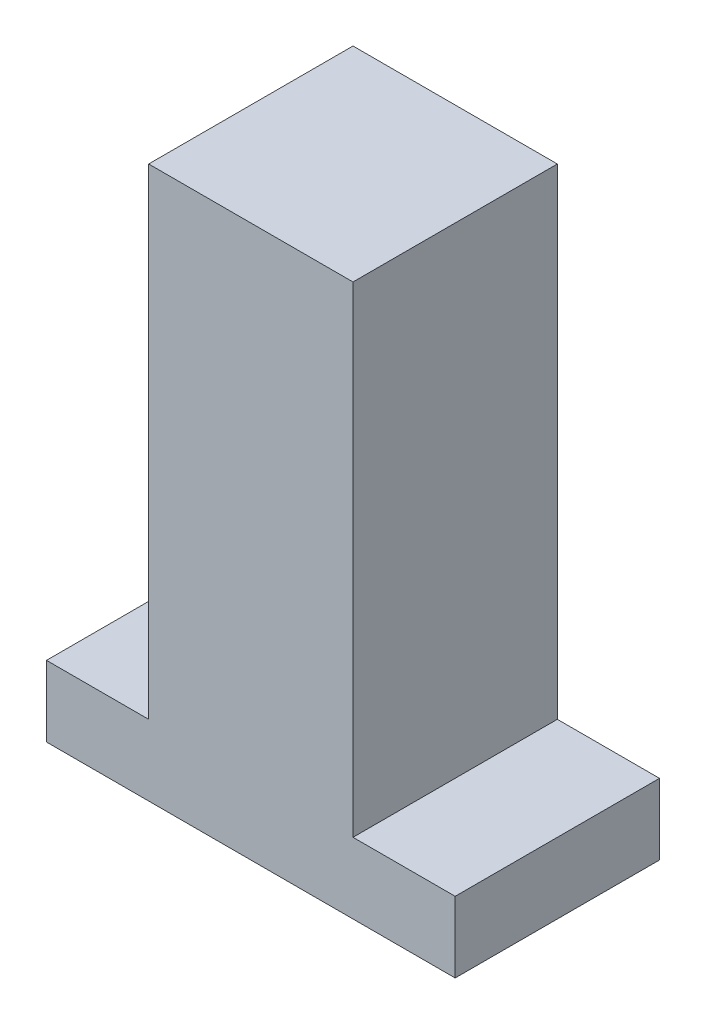
ISO-10303-21;
HEADER;
FILE_DESCRIPTION(('STEP AP214'),'2;1');
FILE_NAME('part.step','',(''),(''),'','','');
FILE_SCHEMA(('AUTOMOTIVE_DESIGN { 1 0 10303 214 1 1 1 1 }'));
ENDSEC;
DATA;
#1=APPLICATION_CONTEXT('core data for automotive mechanical design processes');
#2=APPLICATION_PROTOCOL_DEFINITION('international standard','automotive_design',2000,#1);
#3=PRODUCT_CONTEXT('',#1,'mechanical');
#4=PRODUCT('Part','Part','',(#3));
#5=PRODUCT_RELATED_PRODUCT_CATEGORY('part','',(#4));
#6=PRODUCT_DEFINITION_FORMATION('','',#4);
#7=PRODUCT_DEFINITION_CONTEXT('part definition',#1,'design');
#8=PRODUCT_DEFINITION('design','',#6,#7);
#9=PRODUCT_DEFINITION_SHAPE('','',#8);
#10=(LENGTH_UNIT() NAMED_UNIT(*) SI_UNIT(.MILLI.,.METRE.));
#11=(NAMED_UNIT(*) PLANE_ANGLE_UNIT() SI_UNIT($,.RADIAN.));
#12=(NAMED_UNIT(*) SI_UNIT($,.STERADIAN.) SOLID_ANGLE_UNIT());
#13=UNCERTAINTY_MEASURE_WITH_UNIT(LENGTH_MEASURE(1.E-05),#10,'distance_accuracy_value','');
#14=(GEOMETRIC_REPRESENTATION_CONTEXT(3) GLOBAL_UNCERTAINTY_ASSIGNED_CONTEXT((#13)) GLOBAL_UNIT_ASSIGNED_CONTEXT((#10,
#11,#12)) REPRESENTATION_CONTEXT('',''));
#15=CARTESIAN_POINT('',(0.,0.,0.));
#16=DIRECTION('',(0.,0.,1.));
#17=DIRECTION('',(1.,0.,0.));
#18=AXIS2_PLACEMENT_3D('',#15,#16,#17);
#19=CARTESIAN_POINT('',(0.,-81.,30.));
#20=DIRECTION('',(0.,1.,0.));
#21=DIRECTION('',(0.,0.,1.));
#22=AXIS2_PLACEMENT_3D('',#19,#20,#21);
#23=PLANE('',#22);
#24=DIRECTION('',(1.,0.,0.));
#25=VECTOR('',#24,1.);
#26=CARTESIAN_POINT('',(0.,-81.,0.));
#27=LINE('',#26,#25);
#28=CARTESIAN_POINT('',(-15.,-81.,0.));
#29=VERTEX_POINT('',#28);
#30=CARTESIAN_POINT('',(45.,-81.,0.));
#31=VERTEX_POINT('',#30);
#32=EDGE_CURVE('E132',#29,#31,#27,.T.);
#33=ORIENTED_EDGE('',*,*,#32,.T.);
#34=DIRECTION('',(0.,0.,-1.));
#35=VECTOR('',#34,1.);
#36=CARTESIAN_POINT('',(45.,-81.,30.));
#37=LINE('',#36,#35);
#38=CARTESIAN_POINT('',(45.,-81.,30.));
#39=VERTEX_POINT('',#38);
#40=EDGE_CURVE('E11',#39,#31,#37,.T.);
#41=ORIENTED_EDGE('',*,*,#40,.F.);
#42=DIRECTION('',(1.,0.,0.));
#43=VECTOR('',#42,1.);
#44=CARTESIAN_POINT('',(0.,-81.,30.));
#45=LINE('',#44,#43);
#46=CARTESIAN_POINT('',(-15.,-81.,30.));
#47=VERTEX_POINT('',#46);
#48=EDGE_CURVE('E151',#47,#39,#45,.T.);
#49=ORIENTED_EDGE('',*,*,#48,.F.);
#50=DIRECTION('',(0.,0.,-1.));
#51=VECTOR('',#50,1.);
#52=CARTESIAN_POINT('',(-15.,-81.,30.));
#53=LINE('',#52,#51);
#54=EDGE_CURVE('E51',#47,#29,#53,.T.);
#55=ORIENTED_EDGE('',*,*,#54,.T.);
#56=EDGE_LOOP('',(#33,#41,#49,#55));
#57=FACE_BOUND('',#56,.T.);
#58=ADVANCED_FACE('F35',(#57),#23,.F.);
#59=CARTESIAN_POINT('',(45.,0.,30.));
#60=DIRECTION('',(-1.,0.,0.));
#61=DIRECTION('',(0.,0.,1.));
#62=AXIS2_PLACEMENT_3D('',#59,#60,#61);
#63=PLANE('',#62);
#64=DIRECTION('',(0.,1.,0.));
#65=VECTOR('',#64,1.);
#66=CARTESIAN_POINT('',(45.,0.,0.));
#67=LINE('',#66,#65);
#68=CARTESIAN_POINT('',(45.,-70.6104513064133,0.));
#69=VERTEX_POINT('',#68);
#70=EDGE_CURVE('E134',#31,#69,#67,.T.);
#71=ORIENTED_EDGE('',*,*,#70,.T.);
#72=DIRECTION('',(0.,0.,-1.));
#73=VECTOR('',#72,1.);
#74=CARTESIAN_POINT('',(45.,-70.6104513064133,30.));
#75=LINE('',#74,#73);
#76=CARTESIAN_POINT('',(45.,-70.6104513064133,30.));
#77=VERTEX_POINT('',#76);
#78=EDGE_CURVE('E43',#77,#69,#75,.T.);
#79=ORIENTED_EDGE('',*,*,#78,.F.);
#80=DIRECTION('',(0.,1.,0.));
#81=VECTOR('',#80,1.);
#82=CARTESIAN_POINT('',(45.,0.,30.));
#83=LINE('',#82,#81);
#84=EDGE_CURVE('E90',#39,#77,#83,.T.);
#85=ORIENTED_EDGE('',*,*,#84,.F.);
#86=ORIENTED_EDGE('',*,*,#40,.T.);
#87=EDGE_LOOP('',(#71,#79,#85,#86));
#88=FACE_BOUND('',#87,.T.);
#89=ADVANCED_FACE('F178',(#88),#63,.F.);
#90=CARTESIAN_POINT('',(0.,-70.6104513064133,30.));
#91=DIRECTION('',(0.,-1.,0.));
#92=DIRECTION('',(0.,0.,-1.));
#93=AXIS2_PLACEMENT_3D('',#90,#91,#92);
#94=PLANE('',#93);
#95=DIRECTION('',(-1.,0.,0.));
#96=VECTOR('',#95,1.);
#97=CARTESIAN_POINT('',(0.,-70.6104513064133,0.));
#98=LINE('',#97,#96);
#99=CARTESIAN_POINT('',(30.,-70.6104513064133,0.));
#100=VERTEX_POINT('',#99);
#101=EDGE_CURVE('E136',#69,#100,#98,.T.);
#102=ORIENTED_EDGE('',*,*,#101,.T.);
#103=DIRECTION('',(0.,0.,-1.));
#104=VECTOR('',#103,1.);
#105=CARTESIAN_POINT('',(30.,-70.6104513064133,30.));
#106=LINE('',#105,#104);
#107=CARTESIAN_POINT('',(30.,-70.6104513064133,30.));
#108=VERTEX_POINT('',#107);
#109=EDGE_CURVE('E157',#108,#100,#106,.T.);
#110=ORIENTED_EDGE('',*,*,#109,.F.);
#111=DIRECTION('',(-1.,0.,0.));
#112=VECTOR('',#111,1.);
#113=CARTESIAN_POINT('',(0.,-70.6104513064133,30.));
#114=LINE('',#113,#112);
#115=EDGE_CURVE('E164',#77,#108,#114,.T.);
#116=ORIENTED_EDGE('',*,*,#115,.F.);
#117=ORIENTED_EDGE('',*,*,#78,.T.);
#118=EDGE_LOOP('',(#102,#110,#116,#117));
#119=FACE_BOUND('',#118,.T.);
#120=ADVANCED_FACE('F162',(#119),#94,.F.);
#121=CARTESIAN_POINT('',(30.,0.,30.));
#122=DIRECTION('',(1.,0.,0.));
#123=DIRECTION('',(0.,1.,0.));
#124=AXIS2_PLACEMENT_3D('',#121,#122,#123);
#125=PLANE('',#124);
#126=DIRECTION('',(0.,-1.,0.));
#127=VECTOR('',#126,1.);
#128=CARTESIAN_POINT('',(30.,0.,0.));
#129=LINE('',#128,#127);
#130=CARTESIAN_POINT('',(30.,0.,0.));
#131=VERTEX_POINT('',#130);
#132=EDGE_CURVE('E139',#131,#100,#129,.T.);
#133=ORIENTED_EDGE('',*,*,#132,.F.);
#134=DIRECTION('',(0.,0.,-1.));
#135=VECTOR('',#134,1.);
#136=CARTESIAN_POINT('',(30.,0.,30.));
#137=LINE('',#136,#135);
#138=CARTESIAN_POINT('',(30.,0.,30.));
#139=VERTEX_POINT('',#138);
#140=EDGE_CURVE('E155',#139,#131,#137,.T.);
#141=ORIENTED_EDGE('',*,*,#140,.F.);
#142=DIRECTION('',(0.,-1.,0.));
#143=VECTOR('',#142,1.);
#144=CARTESIAN_POINT('',(30.,0.,30.));
#145=LINE('',#144,#143);
#146=EDGE_CURVE('E172',#139,#108,#145,.T.);
#147=ORIENTED_EDGE('',*,*,#146,.T.);
#148=ORIENTED_EDGE('',*,*,#109,.T.);
#149=EDGE_LOOP('',(#133,#141,#147,#148));
#150=FACE_BOUND('',#149,.T.);
#151=ADVANCED_FACE('F170',(#150),#125,.T.);
#152=CARTESIAN_POINT('',(0.,0.,30.));
#153=DIRECTION('',(0.,1.,0.));
#154=DIRECTION('',(0.,0.,1.));
#155=AXIS2_PLACEMENT_3D('',#152,#153,#154);
#156=PLANE('',#155);
#157=DIRECTION('',(1.,0.,0.));
#158=VECTOR('',#157,1.);
#159=CARTESIAN_POINT('',(0.,0.,0.));
#160=LINE('',#159,#158);
#161=CARTESIAN_POINT('',(0.,0.,0.));
#162=VERTEX_POINT('',#161);
#163=EDGE_CURVE('E142',#162,#131,#160,.T.);
#164=ORIENTED_EDGE('',*,*,#163,.F.);
#165=DIRECTION('',(0.,0.,-1.));
#166=VECTOR('',#165,1.);
#167=CARTESIAN_POINT('',(0.,0.,30.));
#168=LINE('',#167,#166);
#169=CARTESIAN_POINT('',(0.,0.,30.));
#170=VERTEX_POINT('',#169);
#171=EDGE_CURVE('E124',#170,#162,#168,.T.);
#172=ORIENTED_EDGE('',*,*,#171,.F.);
#173=DIRECTION('',(1.,0.,0.));
#174=VECTOR('',#173,1.);
#175=CARTESIAN_POINT('',(0.,0.,30.));
#176=LINE('',#175,#174);
#177=EDGE_CURVE('E114',#170,#139,#176,.T.);
#178=ORIENTED_EDGE('',*,*,#177,.T.);
#179=ORIENTED_EDGE('',*,*,#140,.T.);
#180=EDGE_LOOP('',(#164,#172,#178,#179));
#181=FACE_BOUND('',#180,.T.);
#182=ADVANCED_FACE('F188',(#181),#156,.T.);
#183=CARTESIAN_POINT('',(0.,0.,30.));
#184=DIRECTION('',(1.,0.,0.));
#185=DIRECTION('',(0.,1.,0.));
#186=AXIS2_PLACEMENT_3D('',#183,#184,#185);
#187=PLANE('',#186);
#188=DIRECTION('',(0.,-1.,0.));
#189=VECTOR('',#188,1.);
#190=CARTESIAN_POINT('',(0.,0.,0.));
#191=LINE('',#190,#189);
#192=CARTESIAN_POINT('',(0.,-70.6104513064133,0.));
#193=VERTEX_POINT('',#192);
#194=EDGE_CURVE('E121',#162,#193,#191,.T.);
#195=ORIENTED_EDGE('',*,*,#194,.T.);
#196=DIRECTION('',(0.,0.,-1.));
#197=VECTOR('',#196,1.);
#198=CARTESIAN_POINT('',(0.,-70.6104513064133,30.));
#199=LINE('',#198,#197);
#200=CARTESIAN_POINT('',(0.,-70.6104513064133,30.));
#201=VERTEX_POINT('',#200);
#202=EDGE_CURVE('E118',#201,#193,#199,.T.);
#203=ORIENTED_EDGE('',*,*,#202,.F.);
#204=DIRECTION('',(0.,-1.,0.));
#205=VECTOR('',#204,1.);
#206=CARTESIAN_POINT('',(0.,0.,30.));
#207=LINE('',#206,#205);
#208=EDGE_CURVE('E106',#170,#201,#207,.T.);
#209=ORIENTED_EDGE('',*,*,#208,.F.);
#210=ORIENTED_EDGE('',*,*,#171,.T.);
#211=EDGE_LOOP('',(#195,#203,#209,#210));
#212=FACE_BOUND('',#211,.T.);
#213=ADVANCED_FACE('F119',(#212),#187,.F.);
#214=CARTESIAN_POINT('',(0.,-70.6104513064133,30.));
#215=DIRECTION('',(0.,-1.,0.));
#216=DIRECTION('',(0.,0.,-1.));
#217=AXIS2_PLACEMENT_3D('',#214,#215,#216);
#218=PLANE('',#217);
#219=DIRECTION('',(-1.,0.,0.));
#220=VECTOR('',#219,1.);
#221=CARTESIAN_POINT('',(0.,-70.6104513064133,0.));
#222=LINE('',#221,#220);
#223=CARTESIAN_POINT('',(-15.,-70.6104513064133,0.));
#224=VERTEX_POINT('',#223);
#225=EDGE_CURVE('E146',#193,#224,#222,.T.);
#226=ORIENTED_EDGE('',*,*,#225,.T.);
#227=DIRECTION('',(0.,0.,-1.));
#228=VECTOR('',#227,1.);
#229=CARTESIAN_POINT('',(-15.,-70.6104513064133,30.));
#230=LINE('',#229,#228);
#231=CARTESIAN_POINT('',(-15.,-70.6104513064133,30.));
#232=VERTEX_POINT('',#231);
#233=EDGE_CURVE('E78',#232,#224,#230,.T.);
#234=ORIENTED_EDGE('',*,*,#233,.F.);
#235=DIRECTION('',(-1.,0.,0.));
#236=VECTOR('',#235,1.);
#237=CARTESIAN_POINT('',(0.,-70.6104513064133,30.));
#238=LINE('',#237,#236);
#239=EDGE_CURVE('E111',#201,#232,#238,.T.);
#240=ORIENTED_EDGE('',*,*,#239,.F.);
#241=ORIENTED_EDGE('',*,*,#202,.T.);
#242=EDGE_LOOP('',(#226,#234,#240,#241));
#243=FACE_BOUND('',#242,.T.);
#244=ADVANCED_FACE('F126',(#243),#218,.F.);
#245=CARTESIAN_POINT('',(-15.,0.,30.));
#246=DIRECTION('',(-1.,0.,0.));
#247=DIRECTION('',(0.,0.,1.));
#248=AXIS2_PLACEMENT_3D('',#245,#246,#247);
#249=PLANE('',#248);
#250=DIRECTION('',(0.,1.,0.));
#251=VECTOR('',#250,1.);
#252=CARTESIAN_POINT('',(-15.,0.,0.));
#253=LINE('',#252,#251);
#254=EDGE_CURVE('E148',#29,#224,#253,.T.);
#255=ORIENTED_EDGE('',*,*,#254,.F.);
#256=ORIENTED_EDGE('',*,*,#54,.F.);
#257=DIRECTION('',(0.,1.,0.));
#258=VECTOR('',#257,1.);
#259=CARTESIAN_POINT('',(-15.,0.,30.));
#260=LINE('',#259,#258);
#261=EDGE_CURVE('E127',#47,#232,#260,.T.);
#262=ORIENTED_EDGE('',*,*,#261,.T.);
#263=ORIENTED_EDGE('',*,*,#233,.T.);
#264=EDGE_LOOP('',(#255,#256,#262,#263));
#265=FACE_BOUND('',#264,.T.);
#266=ADVANCED_FACE('F196',(#265),#249,.T.);
#267=CARTESIAN_POINT('',(0.,0.,30.));
#268=DIRECTION('',(0.,0.,1.));
#269=DIRECTION('',(1.,0.,0.));
#270=AXIS2_PLACEMENT_3D('',#267,#268,#269);
#271=PLANE('',#270);
#272=ORIENTED_EDGE('',*,*,#48,.T.);
#273=ORIENTED_EDGE('',*,*,#84,.T.);
#274=ORIENTED_EDGE('',*,*,#115,.T.);
#275=ORIENTED_EDGE('',*,*,#146,.F.);
#276=ORIENTED_EDGE('',*,*,#177,.F.);
#277=ORIENTED_EDGE('',*,*,#208,.T.);
#278=ORIENTED_EDGE('',*,*,#239,.T.);
#279=ORIENTED_EDGE('',*,*,#261,.F.);
#280=EDGE_LOOP('',(#272,#273,#274,#275,#276,#277,#278,#279));
#281=FACE_BOUND('',#280,.T.);
#282=ADVANCED_FACE('F108',(#281),#271,.T.);
#283=CARTESIAN_POINT('',(0.,0.,0.));
#284=DIRECTION('',(0.,0.,1.));
#285=DIRECTION('',(1.,0.,0.));
#286=AXIS2_PLACEMENT_3D('',#283,#284,#285);
#287=PLANE('',#286);
#288=ORIENTED_EDGE('',*,*,#32,.F.);
#289=ORIENTED_EDGE('',*,*,#254,.T.);
#290=ORIENTED_EDGE('',*,*,#225,.F.);
#291=ORIENTED_EDGE('',*,*,#194,.F.);
#292=ORIENTED_EDGE('',*,*,#163,.T.);
#293=ORIENTED_EDGE('',*,*,#132,.T.);
#294=ORIENTED_EDGE('',*,*,#101,.F.);
#295=ORIENTED_EDGE('',*,*,#70,.F.);
#296=EDGE_LOOP('',(#288,#289,#290,#291,#292,#293,#294,#295));
#297=FACE_BOUND('',#296,.T.);
#298=ADVANCED_FACE('F166',(#297),#287,.F.);
#299=CLOSED_SHELL('',(#58,#89,#120,#151,#182,#213,#244,#266,#282,#298));
#300=MANIFOLD_SOLID_BREP('B2',#299);
#301=ADVANCED_BREP_SHAPE_REPRESENTATION('',(#18,#300),#14);
#302=SHAPE_DEFINITION_REPRESENTATION(#9,#301);
ENDSEC;
END-ISO-10303-21;
